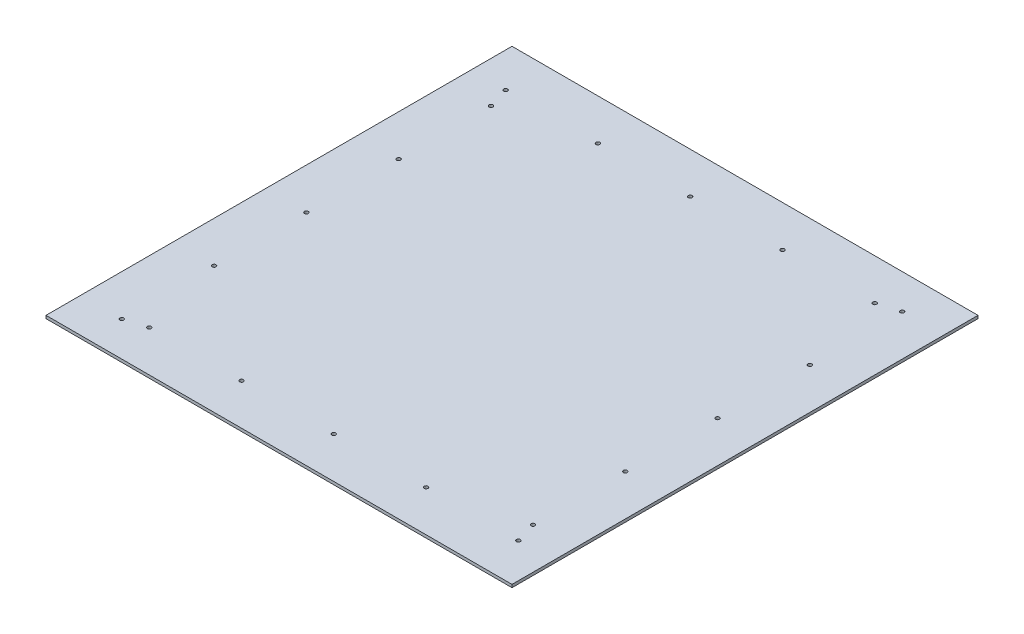
ISO-10303-21;
HEADER;
FILE_DESCRIPTION(('STEP AP214'),'2;1');
FILE_NAME('part.step','',(''),(''),'','','');
FILE_SCHEMA(('AUTOMOTIVE_DESIGN { 1 0 10303 214 1 1 1 1 }'));
ENDSEC;
DATA;
#1=APPLICATION_CONTEXT('core data for automotive mechanical design processes');
#2=APPLICATION_PROTOCOL_DEFINITION('international standard','automotive_design',2000,#1);
#3=PRODUCT_CONTEXT('',#1,'mechanical');
#4=PRODUCT('Part','Part','',(#3));
#5=PRODUCT_RELATED_PRODUCT_CATEGORY('part','',(#4));
#6=PRODUCT_DEFINITION_FORMATION('','',#4);
#7=PRODUCT_DEFINITION_CONTEXT('part definition',#1,'design');
#8=PRODUCT_DEFINITION('design','',#6,#7);
#9=PRODUCT_DEFINITION_SHAPE('','',#8);
#10=(LENGTH_UNIT() NAMED_UNIT(*) SI_UNIT(.MILLI.,.METRE.));
#11=(NAMED_UNIT(*) PLANE_ANGLE_UNIT() SI_UNIT($,.RADIAN.));
#12=(NAMED_UNIT(*) SI_UNIT($,.STERADIAN.) SOLID_ANGLE_UNIT());
#13=UNCERTAINTY_MEASURE_WITH_UNIT(LENGTH_MEASURE(1.E-05),#10,'distance_accuracy_value','');
#14=(GEOMETRIC_REPRESENTATION_CONTEXT(3) GLOBAL_UNCERTAINTY_ASSIGNED_CONTEXT((#13)) GLOBAL_UNIT_ASSIGNED_CONTEXT((#10,
#11,#12)) REPRESENTATION_CONTEXT('',''));
#15=CARTESIAN_POINT('',(0.,0.,0.));
#16=DIRECTION('',(0.,0.,1.));
#17=DIRECTION('',(1.,0.,0.));
#18=AXIS2_PLACEMENT_3D('',#15,#16,#17);
#19=CARTESIAN_POINT('',(255.,3.175,255.));
#20=DIRECTION('',(-1.,0.,0.));
#21=DIRECTION('',(0.,0.,1.));
#22=AXIS2_PLACEMENT_3D('',#19,#20,#21);
#23=PLANE('',#22);
#24=DIRECTION('',(0.,0.,-1.));
#25=VECTOR('',#24,1.);
#26=CARTESIAN_POINT('',(255.,0.,255.));
#27=LINE('',#26,#25);
#28=CARTESIAN_POINT('',(255.,0.,255.));
#29=VERTEX_POINT('',#28);
#30=CARTESIAN_POINT('',(255.,0.,-255.));
#31=VERTEX_POINT('',#30);
#32=EDGE_CURVE('E113',#29,#31,#27,.T.);
#33=ORIENTED_EDGE('',*,*,#32,.T.);
#34=DIRECTION('',(0.,-1.,0.));
#35=VECTOR('',#34,1.);
#36=CARTESIAN_POINT('',(255.,3.175,-255.));
#37=LINE('',#36,#35);
#38=CARTESIAN_POINT('',(255.,3.175,-255.));
#39=VERTEX_POINT('',#38);
#40=EDGE_CURVE('E11',#39,#31,#37,.T.);
#41=ORIENTED_EDGE('',*,*,#40,.F.);
#42=DIRECTION('',(0.,0.,-1.));
#43=VECTOR('',#42,1.);
#44=CARTESIAN_POINT('',(255.,3.175,255.));
#45=LINE('',#44,#43);
#46=CARTESIAN_POINT('',(255.,3.175,255.));
#47=VERTEX_POINT('',#46);
#48=EDGE_CURVE('E96',#47,#39,#45,.T.);
#49=ORIENTED_EDGE('',*,*,#48,.F.);
#50=DIRECTION('',(0.,-1.,0.));
#51=VECTOR('',#50,1.);
#52=CARTESIAN_POINT('',(255.,3.175,255.));
#53=LINE('',#52,#51);
#54=EDGE_CURVE('E109',#47,#29,#53,.T.);
#55=ORIENTED_EDGE('',*,*,#54,.T.);
#56=EDGE_LOOP('',(#33,#41,#49,#55));
#57=FACE_BOUND('',#56,.T.);
#58=ADVANCED_FACE('F39',(#57),#23,.F.);
#59=CARTESIAN_POINT('',(-255.,3.175,-255.));
#60=DIRECTION('',(0.,0.,1.));
#61=DIRECTION('',(1.,0.,0.));
#62=AXIS2_PLACEMENT_3D('',#59,#60,#61);
#63=PLANE('',#62);
#64=DIRECTION('',(-1.,0.,0.));
#65=VECTOR('',#64,1.);
#66=CARTESIAN_POINT('',(-255.,0.,-255.));
#67=LINE('',#66,#65);
#68=CARTESIAN_POINT('',(-255.,0.,-255.));
#69=VERTEX_POINT('',#68);
#70=EDGE_CURVE('E101',#31,#69,#67,.T.);
#71=ORIENTED_EDGE('',*,*,#70,.T.);
#72=DIRECTION('',(0.,-1.,0.));
#73=VECTOR('',#72,1.);
#74=CARTESIAN_POINT('',(-255.,3.175,-255.));
#75=LINE('',#74,#73);
#76=CARTESIAN_POINT('',(-255.,3.175,-255.));
#77=VERTEX_POINT('',#76);
#78=EDGE_CURVE('E47',#77,#69,#75,.T.);
#79=ORIENTED_EDGE('',*,*,#78,.F.);
#80=DIRECTION('',(-1.,0.,0.));
#81=VECTOR('',#80,1.);
#82=CARTESIAN_POINT('',(-255.,3.175,-255.));
#83=LINE('',#82,#81);
#84=EDGE_CURVE('E90',#39,#77,#83,.T.);
#85=ORIENTED_EDGE('',*,*,#84,.F.);
#86=ORIENTED_EDGE('',*,*,#40,.T.);
#87=EDGE_LOOP('',(#71,#79,#85,#86));
#88=FACE_BOUND('',#87,.T.);
#89=ADVANCED_FACE('F100',(#88),#63,.F.);
#90=CARTESIAN_POINT('',(-255.,3.175,255.));
#91=DIRECTION('',(1.,0.,0.));
#92=DIRECTION('',(0.,0.,-1.));
#93=AXIS2_PLACEMENT_3D('',#90,#91,#92);
#94=PLANE('',#93);
#95=DIRECTION('',(0.,0.,1.));
#96=VECTOR('',#95,1.);
#97=CARTESIAN_POINT('',(-255.,0.,255.));
#98=LINE('',#97,#96);
#99=CARTESIAN_POINT('',(-255.,0.,255.));
#100=VERTEX_POINT('',#99);
#101=EDGE_CURVE('E77',#69,#100,#98,.T.);
#102=ORIENTED_EDGE('',*,*,#101,.T.);
#103=DIRECTION('',(0.,-1.,0.));
#104=VECTOR('',#103,1.);
#105=CARTESIAN_POINT('',(-255.,3.175,255.));
#106=LINE('',#105,#104);
#107=CARTESIAN_POINT('',(-255.,3.175,255.));
#108=VERTEX_POINT('',#107);
#109=EDGE_CURVE('E103',#108,#100,#106,.T.);
#110=ORIENTED_EDGE('',*,*,#109,.F.);
#111=DIRECTION('',(0.,0.,1.));
#112=VECTOR('',#111,1.);
#113=CARTESIAN_POINT('',(-255.,3.175,255.));
#114=LINE('',#113,#112);
#115=EDGE_CURVE('E94',#77,#108,#114,.T.);
#116=ORIENTED_EDGE('',*,*,#115,.F.);
#117=ORIENTED_EDGE('',*,*,#78,.T.);
#118=EDGE_LOOP('',(#102,#110,#116,#117));
#119=FACE_BOUND('',#118,.T.);
#120=ADVANCED_FACE('F104',(#119),#94,.F.);
#121=CARTESIAN_POINT('',(-255.,3.175,255.));
#122=DIRECTION('',(0.,0.,-1.));
#123=DIRECTION('',(-1.,0.,0.));
#124=AXIS2_PLACEMENT_3D('',#121,#122,#123);
#125=PLANE('',#124);
#126=DIRECTION('',(1.,0.,0.));
#127=VECTOR('',#126,1.);
#128=CARTESIAN_POINT('',(-255.,0.,255.));
#129=LINE('',#128,#127);
#130=EDGE_CURVE('E83',#100,#29,#129,.T.);
#131=ORIENTED_EDGE('',*,*,#130,.T.);
#132=ORIENTED_EDGE('',*,*,#54,.F.);
#133=DIRECTION('',(1.,0.,0.));
#134=VECTOR('',#133,1.);
#135=CARTESIAN_POINT('',(-255.,3.175,255.));
#136=LINE('',#135,#134);
#137=EDGE_CURVE('E58',#108,#47,#136,.T.);
#138=ORIENTED_EDGE('',*,*,#137,.F.);
#139=ORIENTED_EDGE('',*,*,#109,.T.);
#140=EDGE_LOOP('',(#131,#132,#138,#139));
#141=FACE_BOUND('',#140,.T.);
#142=ADVANCED_FACE('F127',(#141),#125,.F.);
#143=CARTESIAN_POINT('',(0.,3.175,0.));
#144=DIRECTION('',(0.,-1.,0.));
#145=DIRECTION('',(0.,0.,-1.));
#146=AXIS2_PLACEMENT_3D('',#143,#144,#145);
#147=PLANE('',#146);
#148=CARTESIAN_POINT('',(217.,3.175,210.));
#149=DIRECTION('',(0.,-1.,0.));
#150=DIRECTION('',(0.,0.,-1.));
#151=AXIS2_PLACEMENT_3D('',#148,#149,#150);
#152=CIRCLE('',#151,2.09999999999999);
#153=CARTESIAN_POINT('',(217.,3.175,207.9));
#154=VERTEX_POINT('',#153);
#155=EDGE_CURVE('E117',#154,#154,#152,.T.);
#156=ORIENTED_EDGE('',*,*,#155,.T.);
#157=EDGE_LOOP('',(#156));
#158=FACE_BOUND('',#157,.T.);
#159=CARTESIAN_POINT('',(209.999999999999,3.175,187.));
#160=DIRECTION('',(0.,-1.,0.));
#161=DIRECTION('',(0.,0.,-1.));
#162=AXIS2_PLACEMENT_3D('',#159,#160,#161);
#163=CIRCLE('',#162,2.09999999999999);
#164=CARTESIAN_POINT('',(209.999999999999,3.175,184.9));
#165=VERTEX_POINT('',#164);
#166=EDGE_CURVE('E265',#165,#165,#163,.T.);
#167=ORIENTED_EDGE('',*,*,#166,.T.);
#168=EDGE_LOOP('',(#167));
#169=FACE_BOUND('',#168,.T.);
#170=CARTESIAN_POINT('',(209.999999999999,3.175,86.0000000000001));
#171=DIRECTION('',(0.,-1.,0.));
#172=DIRECTION('',(0.,0.,-1.));
#173=AXIS2_PLACEMENT_3D('',#170,#171,#172);
#174=CIRCLE('',#173,2.09999999999999);
#175=CARTESIAN_POINT('',(209.999999999999,3.175,83.9000000000001));
#176=VERTEX_POINT('',#175);
#177=EDGE_CURVE('E272',#176,#176,#174,.T.);
#178=ORIENTED_EDGE('',*,*,#177,.T.);
#179=EDGE_LOOP('',(#178));
#180=FACE_BOUND('',#179,.T.);
#181=CARTESIAN_POINT('',(209.999999999999,3.175,-15.));
#182=DIRECTION('',(0.,-1.,0.));
#183=DIRECTION('',(0.,0.,-1.));
#184=AXIS2_PLACEMENT_3D('',#181,#182,#183);
#185=CIRCLE('',#184,2.09999999999999);
#186=CARTESIAN_POINT('',(209.999999999999,3.175,-17.0999999999999));
#187=VERTEX_POINT('',#186);
#188=EDGE_CURVE('E235',#187,#187,#185,.T.);
#189=ORIENTED_EDGE('',*,*,#188,.T.);
#190=EDGE_LOOP('',(#189));
#191=FACE_BOUND('',#190,.T.);
#192=CARTESIAN_POINT('',(-187.,3.175,209.999999999997));
#193=DIRECTION('',(0.,-1.,0.));
#194=DIRECTION('',(0.,0.,-1.));
#195=AXIS2_PLACEMENT_3D('',#192,#193,#194);
#196=CIRCLE('',#195,2.09999999999999);
#197=CARTESIAN_POINT('',(-187.,3.175,207.899999999997));
#198=VERTEX_POINT('',#197);
#199=EDGE_CURVE('E158',#198,#198,#196,.T.);
#200=ORIENTED_EDGE('',*,*,#199,.T.);
#201=EDGE_LOOP('',(#200));
#202=FACE_BOUND('',#201,.T.);
#203=CARTESIAN_POINT('',(-217.,3.175,-210.));
#204=DIRECTION('',(0.,-1.,0.));
#205=DIRECTION('',(0.,0.,-1.));
#206=AXIS2_PLACEMENT_3D('',#203,#204,#205);
#207=CIRCLE('',#206,2.09999999999999);
#208=CARTESIAN_POINT('',(-217.,3.175,-212.1));
#209=VERTEX_POINT('',#208);
#210=EDGE_CURVE('E173',#209,#209,#207,.T.);
#211=ORIENTED_EDGE('',*,*,#210,.T.);
#212=EDGE_LOOP('',(#211));
#213=FACE_BOUND('',#212,.T.);
#214=CARTESIAN_POINT('',(-209.999999999999,3.175,116.));
#215=DIRECTION('',(0.,-1.,0.));
#216=DIRECTION('',(0.,0.,-1.));
#217=AXIS2_PLACEMENT_3D('',#214,#215,#216);
#218=CIRCLE('',#217,2.09999999999999);
#219=CARTESIAN_POINT('',(-209.999999999999,3.175,113.9));
#220=VERTEX_POINT('',#219);
#221=EDGE_CURVE('E174',#220,#220,#218,.T.);
#222=ORIENTED_EDGE('',*,*,#221,.T.);
#223=EDGE_LOOP('',(#222));
#224=FACE_BOUND('',#223,.T.);
#225=CARTESIAN_POINT('',(-209.999999999998,3.175,15.));
#226=DIRECTION('',(0.,-1.,0.));
#227=DIRECTION('',(0.,0.,-1.));
#228=AXIS2_PLACEMENT_3D('',#225,#226,#227);
#229=CIRCLE('',#228,2.09999999999999);
#230=CARTESIAN_POINT('',(-209.999999999998,3.175,12.9));
#231=VERTEX_POINT('',#230);
#232=EDGE_CURVE('E189',#231,#231,#229,.T.);
#233=ORIENTED_EDGE('',*,*,#232,.T.);
#234=EDGE_LOOP('',(#233));
#235=FACE_BOUND('',#234,.T.);
#236=CARTESIAN_POINT('',(-210.,3.175,217.));
#237=DIRECTION('',(0.,-1.,0.));
#238=DIRECTION('',(0.,0.,-1.));
#239=AXIS2_PLACEMENT_3D('',#236,#237,#238);
#240=CIRCLE('',#239,2.09999999999999);
#241=CARTESIAN_POINT('',(-210.,3.175,214.9));
#242=VERTEX_POINT('',#241);
#243=EDGE_CURVE('E148',#242,#242,#240,.T.);
#244=ORIENTED_EDGE('',*,*,#243,.T.);
#245=EDGE_LOOP('',(#244));
#246=FACE_BOUND('',#245,.T.);
#247=CARTESIAN_POINT('',(116.,3.175,209.999999999999));
#248=DIRECTION('',(0.,-1.,0.));
#249=DIRECTION('',(0.,0.,-1.));
#250=AXIS2_PLACEMENT_3D('',#247,#248,#249);
#251=CIRCLE('',#250,2.1);
#252=CARTESIAN_POINT('',(116.,3.175,207.899999999999));
#253=VERTEX_POINT('',#252);
#254=EDGE_CURVE('E139',#253,#253,#251,.T.);
#255=ORIENTED_EDGE('',*,*,#254,.T.);
#256=EDGE_LOOP('',(#255));
#257=FACE_BOUND('',#256,.T.);
#258=CARTESIAN_POINT('',(15.,3.175,209.999999999999));
#259=DIRECTION('',(0.,-1.,0.));
#260=DIRECTION('',(0.,0.,-1.));
#261=AXIS2_PLACEMENT_3D('',#258,#259,#260);
#262=CIRCLE('',#261,2.1);
#263=CARTESIAN_POINT('',(15.,3.175,207.899999999999));
#264=VERTEX_POINT('',#263);
#265=EDGE_CURVE('E140',#264,#264,#262,.T.);
#266=ORIENTED_EDGE('',*,*,#265,.T.);
#267=EDGE_LOOP('',(#266));
#268=FACE_BOUND('',#267,.T.);
#269=CARTESIAN_POINT('',(-86.0000000000001,3.175,209.999999999998));
#270=DIRECTION('',(0.,-1.,0.));
#271=DIRECTION('',(0.,0.,-1.));
#272=AXIS2_PLACEMENT_3D('',#269,#270,#271);
#273=CIRCLE('',#272,2.1);
#274=CARTESIAN_POINT('',(-86.0000000000001,3.175,207.899999999998));
#275=VERTEX_POINT('',#274);
#276=EDGE_CURVE('E157',#275,#275,#273,.T.);
#277=ORIENTED_EDGE('',*,*,#276,.T.);
#278=EDGE_LOOP('',(#277));
#279=FACE_BOUND('',#278,.T.);
#280=CARTESIAN_POINT('',(210.,3.175,-116.));
#281=DIRECTION('',(0.,-1.,0.));
#282=DIRECTION('',(0.,0.,-1.));
#283=AXIS2_PLACEMENT_3D('',#280,#281,#282);
#284=CIRCLE('',#283,2.09999999999999);
#285=CARTESIAN_POINT('',(210.,3.175,-118.1));
#286=VERTEX_POINT('',#285);
#287=EDGE_CURVE('E234',#286,#286,#284,.T.);
#288=ORIENTED_EDGE('',*,*,#287,.T.);
#289=EDGE_LOOP('',(#288));
#290=FACE_BOUND('',#289,.T.);
#291=CARTESIAN_POINT('',(187.,3.175,-210.));
#292=DIRECTION('',(0.,-1.,0.));
#293=DIRECTION('',(0.,0.,-1.));
#294=AXIS2_PLACEMENT_3D('',#291,#292,#293);
#295=CIRCLE('',#294,2.09999999999999);
#296=CARTESIAN_POINT('',(187.,3.175,-212.1));
#297=VERTEX_POINT('',#296);
#298=EDGE_CURVE('E243',#297,#297,#295,.T.);
#299=ORIENTED_EDGE('',*,*,#298,.T.);
#300=EDGE_LOOP('',(#299));
#301=FACE_BOUND('',#300,.T.);
#302=CARTESIAN_POINT('',(86.0000000000001,3.175,-210.));
#303=DIRECTION('',(0.,-1.,0.));
#304=DIRECTION('',(0.,0.,-1.));
#305=AXIS2_PLACEMENT_3D('',#302,#303,#304);
#306=CIRCLE('',#305,2.1);
#307=CARTESIAN_POINT('',(86.0000000000001,3.175,-212.1));
#308=VERTEX_POINT('',#307);
#309=EDGE_CURVE('E251',#308,#308,#306,.T.);
#310=ORIENTED_EDGE('',*,*,#309,.T.);
#311=EDGE_LOOP('',(#310));
#312=FACE_BOUND('',#311,.T.);
#313=CARTESIAN_POINT('',(-15.,3.175,-210.));
#314=DIRECTION('',(0.,-1.,0.));
#315=DIRECTION('',(0.,0.,-1.));
#316=AXIS2_PLACEMENT_3D('',#313,#314,#315);
#317=CIRCLE('',#316,2.1);
#318=CARTESIAN_POINT('',(-15.,3.175,-212.1));
#319=VERTEX_POINT('',#318);
#320=EDGE_CURVE('E206',#319,#319,#317,.T.);
#321=ORIENTED_EDGE('',*,*,#320,.T.);
#322=EDGE_LOOP('',(#321));
#323=FACE_BOUND('',#322,.T.);
#324=CARTESIAN_POINT('',(-116.,3.175,-210.));
#325=DIRECTION('',(0.,-1.,0.));
#326=DIRECTION('',(0.,0.,-1.));
#327=AXIS2_PLACEMENT_3D('',#324,#325,#326);
#328=CIRCLE('',#327,2.1);
#329=CARTESIAN_POINT('',(-116.,3.175,-212.1));
#330=VERTEX_POINT('',#329);
#331=EDGE_CURVE('E205',#330,#330,#328,.T.);
#332=ORIENTED_EDGE('',*,*,#331,.T.);
#333=EDGE_LOOP('',(#332));
#334=FACE_BOUND('',#333,.T.);
#335=CARTESIAN_POINT('',(210.,3.175,-217.));
#336=DIRECTION('',(0.,-1.,0.));
#337=DIRECTION('',(0.,0.,-1.));
#338=AXIS2_PLACEMENT_3D('',#335,#336,#337);
#339=CIRCLE('',#338,2.09999999999999);
#340=CARTESIAN_POINT('',(210.,3.175,-219.1));
#341=VERTEX_POINT('',#340);
#342=EDGE_CURVE('E213',#341,#341,#339,.T.);
#343=ORIENTED_EDGE('',*,*,#342,.T.);
#344=EDGE_LOOP('',(#343));
#345=FACE_BOUND('',#344,.T.);
#346=CARTESIAN_POINT('',(-209.999999999996,3.175,-187.));
#347=DIRECTION('',(0.,-1.,0.));
#348=DIRECTION('',(0.,0.,-1.));
#349=AXIS2_PLACEMENT_3D('',#346,#347,#348);
#350=CIRCLE('',#349,2.09999999999999);
#351=CARTESIAN_POINT('',(-209.999999999996,3.175,-189.1));
#352=VERTEX_POINT('',#351);
#353=EDGE_CURVE('E220',#352,#352,#350,.T.);
#354=ORIENTED_EDGE('',*,*,#353,.T.);
#355=EDGE_LOOP('',(#354));
#356=FACE_BOUND('',#355,.T.);
#357=CARTESIAN_POINT('',(-209.999999999997,3.175,-86.0000000000001));
#358=DIRECTION('',(0.,-1.,0.));
#359=DIRECTION('',(0.,0.,-1.));
#360=AXIS2_PLACEMENT_3D('',#357,#358,#359);
#361=CIRCLE('',#360,2.09999999999999);
#362=CARTESIAN_POINT('',(-209.999999999997,3.175,-88.1000000000001));
#363=VERTEX_POINT('',#362);
#364=EDGE_CURVE('E190',#363,#363,#361,.T.);
#365=ORIENTED_EDGE('',*,*,#364,.T.);
#366=EDGE_LOOP('',(#365));
#367=FACE_BOUND('',#366,.T.);
#368=ORIENTED_EDGE('',*,*,#48,.T.);
#369=ORIENTED_EDGE('',*,*,#84,.T.);
#370=ORIENTED_EDGE('',*,*,#115,.T.);
#371=ORIENTED_EDGE('',*,*,#137,.T.);
#372=EDGE_LOOP('',(#368,#369,#370,#371));
#373=FACE_BOUND('',#372,.T.);
#374=ADVANCED_FACE('F92',(#158,#169,#180,#191,#202,#213,#224,#235,#246,#257,#268,#279,#290,#301,
#312,#323,#334,#345,#356,#367,#373),#147,.F.);
#375=CARTESIAN_POINT('',(0.,0.,0.));
#376=DIRECTION('',(0.,-1.,0.));
#377=DIRECTION('',(0.,0.,-1.));
#378=AXIS2_PLACEMENT_3D('',#375,#376,#377);
#379=PLANE('',#378);
#380=CARTESIAN_POINT('',(217.,0.,210.));
#381=DIRECTION('',(0.,-1.,0.));
#382=DIRECTION('',(0.,0.,-1.));
#383=AXIS2_PLACEMENT_3D('',#380,#381,#382);
#384=CIRCLE('',#383,2.09999999999999);
#385=CARTESIAN_POINT('',(217.,0.,207.9));
#386=VERTEX_POINT('',#385);
#387=EDGE_CURVE('E152',#386,#386,#384,.T.);
#388=ORIENTED_EDGE('',*,*,#387,.F.);
#389=EDGE_LOOP('',(#388));
#390=FACE_BOUND('',#389,.T.);
#391=CARTESIAN_POINT('',(209.999999999999,0.,187.));
#392=DIRECTION('',(0.,-1.,0.));
#393=DIRECTION('',(0.,0.,-1.));
#394=AXIS2_PLACEMENT_3D('',#391,#392,#393);
#395=CIRCLE('',#394,2.09999999999999);
#396=CARTESIAN_POINT('',(209.999999999999,0.,184.9));
#397=VERTEX_POINT('',#396);
#398=EDGE_CURVE('E262',#397,#397,#395,.T.);
#399=ORIENTED_EDGE('',*,*,#398,.F.);
#400=EDGE_LOOP('',(#399));
#401=FACE_BOUND('',#400,.T.);
#402=CARTESIAN_POINT('',(209.999999999999,0.,86.0000000000001));
#403=DIRECTION('',(0.,-1.,0.));
#404=DIRECTION('',(0.,0.,-1.));
#405=AXIS2_PLACEMENT_3D('',#402,#403,#404);
#406=CIRCLE('',#405,2.09999999999999);
#407=CARTESIAN_POINT('',(209.999999999999,0.,83.9000000000001));
#408=VERTEX_POINT('',#407);
#409=EDGE_CURVE('E268',#408,#408,#406,.T.);
#410=ORIENTED_EDGE('',*,*,#409,.F.);
#411=EDGE_LOOP('',(#410));
#412=FACE_BOUND('',#411,.T.);
#413=CARTESIAN_POINT('',(209.999999999999,0.,-15.));
#414=DIRECTION('',(0.,-1.,0.));
#415=DIRECTION('',(0.,0.,-1.));
#416=AXIS2_PLACEMENT_3D('',#413,#414,#415);
#417=CIRCLE('',#416,2.09999999999999);
#418=CARTESIAN_POINT('',(209.999999999999,0.,-17.0999999999999));
#419=VERTEX_POINT('',#418);
#420=EDGE_CURVE('E275',#419,#419,#417,.T.);
#421=ORIENTED_EDGE('',*,*,#420,.F.);
#422=EDGE_LOOP('',(#421));
#423=FACE_BOUND('',#422,.T.);
#424=CARTESIAN_POINT('',(-187.,0.,209.999999999997));
#425=DIRECTION('',(0.,-1.,0.));
#426=DIRECTION('',(0.,0.,-1.));
#427=AXIS2_PLACEMENT_3D('',#424,#425,#426);
#428=CIRCLE('',#427,2.09999999999999);
#429=CARTESIAN_POINT('',(-187.,0.,207.899999999997));
#430=VERTEX_POINT('',#429);
#431=EDGE_CURVE('E178',#430,#430,#428,.T.);
#432=ORIENTED_EDGE('',*,*,#431,.F.);
#433=EDGE_LOOP('',(#432));
#434=FACE_BOUND('',#433,.T.);
#435=CARTESIAN_POINT('',(-217.,0.,-210.));
#436=DIRECTION('',(0.,-1.,0.));
#437=DIRECTION('',(0.,0.,-1.));
#438=AXIS2_PLACEMENT_3D('',#435,#436,#437);
#439=CIRCLE('',#438,2.09999999999999);
#440=CARTESIAN_POINT('',(-217.,0.,-212.1));
#441=VERTEX_POINT('',#440);
#442=EDGE_CURVE('E169',#441,#441,#439,.T.);
#443=ORIENTED_EDGE('',*,*,#442,.F.);
#444=EDGE_LOOP('',(#443));
#445=FACE_BOUND('',#444,.T.);
#446=CARTESIAN_POINT('',(-209.999999999999,0.,116.));
#447=DIRECTION('',(0.,-1.,0.));
#448=DIRECTION('',(0.,0.,-1.));
#449=AXIS2_PLACEMENT_3D('',#446,#447,#448);
#450=CIRCLE('',#449,2.09999999999999);
#451=CARTESIAN_POINT('',(-209.999999999999,0.,113.9));
#452=VERTEX_POINT('',#451);
#453=EDGE_CURVE('E194',#452,#452,#450,.T.);
#454=ORIENTED_EDGE('',*,*,#453,.F.);
#455=EDGE_LOOP('',(#454));
#456=FACE_BOUND('',#455,.T.);
#457=CARTESIAN_POINT('',(-209.999999999998,0.,15.));
#458=DIRECTION('',(0.,-1.,0.));
#459=DIRECTION('',(0.,0.,-1.));
#460=AXIS2_PLACEMENT_3D('',#457,#458,#459);
#461=CIRCLE('',#460,2.09999999999999);
#462=CARTESIAN_POINT('',(-209.999999999998,0.,12.9));
#463=VERTEX_POINT('',#462);
#464=EDGE_CURVE('E185',#463,#463,#461,.T.);
#465=ORIENTED_EDGE('',*,*,#464,.F.);
#466=EDGE_LOOP('',(#465));
#467=FACE_BOUND('',#466,.T.);
#468=CARTESIAN_POINT('',(-210.,0.,217.));
#469=DIRECTION('',(0.,-1.,0.));
#470=DIRECTION('',(0.,0.,-1.));
#471=AXIS2_PLACEMENT_3D('',#468,#469,#470);
#472=CIRCLE('',#471,2.09999999999999);
#473=CARTESIAN_POINT('',(-210.,0.,214.9));
#474=VERTEX_POINT('',#473);
#475=EDGE_CURVE('E144',#474,#474,#472,.T.);
#476=ORIENTED_EDGE('',*,*,#475,.F.);
#477=EDGE_LOOP('',(#476));
#478=FACE_BOUND('',#477,.T.);
#479=CARTESIAN_POINT('',(116.,0.,209.999999999999));
#480=DIRECTION('',(0.,-1.,0.));
#481=DIRECTION('',(0.,0.,-1.));
#482=AXIS2_PLACEMENT_3D('',#479,#480,#481);
#483=CIRCLE('',#482,2.1);
#484=CARTESIAN_POINT('',(116.,0.,207.899999999999));
#485=VERTEX_POINT('',#484);
#486=EDGE_CURVE('E135',#485,#485,#483,.T.);
#487=ORIENTED_EDGE('',*,*,#486,.F.);
#488=EDGE_LOOP('',(#487));
#489=FACE_BOUND('',#488,.T.);
#490=CARTESIAN_POINT('',(15.,0.,209.999999999999));
#491=DIRECTION('',(0.,-1.,0.));
#492=DIRECTION('',(0.,0.,-1.));
#493=AXIS2_PLACEMENT_3D('',#490,#491,#492);
#494=CIRCLE('',#493,2.1);
#495=CARTESIAN_POINT('',(15.,0.,207.899999999999));
#496=VERTEX_POINT('',#495);
#497=EDGE_CURVE('E162',#496,#496,#494,.T.);
#498=ORIENTED_EDGE('',*,*,#497,.F.);
#499=EDGE_LOOP('',(#498));
#500=FACE_BOUND('',#499,.T.);
#501=CARTESIAN_POINT('',(-86.0000000000001,0.,209.999999999998));
#502=DIRECTION('',(0.,-1.,0.));
#503=DIRECTION('',(0.,0.,-1.));
#504=AXIS2_PLACEMENT_3D('',#501,#502,#503);
#505=CIRCLE('',#504,2.1);
#506=CARTESIAN_POINT('',(-86.0000000000001,0.,207.899999999998));
#507=VERTEX_POINT('',#506);
#508=EDGE_CURVE('E153',#507,#507,#505,.T.);
#509=ORIENTED_EDGE('',*,*,#508,.F.);
#510=EDGE_LOOP('',(#509));
#511=FACE_BOUND('',#510,.T.);
#512=CARTESIAN_POINT('',(210.,0.,-116.));
#513=DIRECTION('',(0.,-1.,0.));
#514=DIRECTION('',(0.,0.,-1.));
#515=AXIS2_PLACEMENT_3D('',#512,#513,#514);
#516=CIRCLE('',#515,2.09999999999999);
#517=CARTESIAN_POINT('',(210.,0.,-118.1));
#518=VERTEX_POINT('',#517);
#519=EDGE_CURVE('E230',#518,#518,#516,.T.);
#520=ORIENTED_EDGE('',*,*,#519,.F.);
#521=EDGE_LOOP('',(#520));
#522=FACE_BOUND('',#521,.T.);
#523=CARTESIAN_POINT('',(187.,0.,-210.));
#524=DIRECTION('',(0.,-1.,0.));
#525=DIRECTION('',(0.,0.,-1.));
#526=AXIS2_PLACEMENT_3D('',#523,#524,#525);
#527=CIRCLE('',#526,2.09999999999999);
#528=CARTESIAN_POINT('',(187.,0.,-212.1));
#529=VERTEX_POINT('',#528);
#530=EDGE_CURVE('E239',#529,#529,#527,.T.);
#531=ORIENTED_EDGE('',*,*,#530,.F.);
#532=EDGE_LOOP('',(#531));
#533=FACE_BOUND('',#532,.T.);
#534=CARTESIAN_POINT('',(86.0000000000001,0.,-210.));
#535=DIRECTION('',(0.,-1.,0.));
#536=DIRECTION('',(0.,0.,-1.));
#537=AXIS2_PLACEMENT_3D('',#534,#535,#536);
#538=CIRCLE('',#537,2.1);
#539=CARTESIAN_POINT('',(86.0000000000001,0.,-212.1));
#540=VERTEX_POINT('',#539);
#541=EDGE_CURVE('E247',#540,#540,#538,.T.);
#542=ORIENTED_EDGE('',*,*,#541,.F.);
#543=EDGE_LOOP('',(#542));
#544=FACE_BOUND('',#543,.T.);
#545=CARTESIAN_POINT('',(-15.,0.,-210.));
#546=DIRECTION('',(0.,-1.,0.));
#547=DIRECTION('',(0.,0.,-1.));
#548=AXIS2_PLACEMENT_3D('',#545,#546,#547);
#549=CIRCLE('',#548,2.1);
#550=CARTESIAN_POINT('',(-15.,0.,-212.1));
#551=VERTEX_POINT('',#550);
#552=EDGE_CURVE('E255',#551,#551,#549,.T.);
#553=ORIENTED_EDGE('',*,*,#552,.F.);
#554=EDGE_LOOP('',(#553));
#555=FACE_BOUND('',#554,.T.);
#556=CARTESIAN_POINT('',(-116.,0.,-210.));
#557=DIRECTION('',(0.,-1.,0.));
#558=DIRECTION('',(0.,0.,-1.));
#559=AXIS2_PLACEMENT_3D('',#556,#557,#558);
#560=CIRCLE('',#559,2.1);
#561=CARTESIAN_POINT('',(-116.,0.,-212.1));
#562=VERTEX_POINT('',#561);
#563=EDGE_CURVE('E201',#562,#562,#560,.T.);
#564=ORIENTED_EDGE('',*,*,#563,.F.);
#565=EDGE_LOOP('',(#564));
#566=FACE_BOUND('',#565,.T.);
#567=CARTESIAN_POINT('',(210.,0.,-217.));
#568=DIRECTION('',(0.,-1.,0.));
#569=DIRECTION('',(0.,0.,-1.));
#570=AXIS2_PLACEMENT_3D('',#567,#568,#569);
#571=CIRCLE('',#570,2.09999999999999);
#572=CARTESIAN_POINT('',(210.,0.,-219.1));
#573=VERTEX_POINT('',#572);
#574=EDGE_CURVE('E210',#573,#573,#571,.T.);
#575=ORIENTED_EDGE('',*,*,#574,.F.);
#576=EDGE_LOOP('',(#575));
#577=FACE_BOUND('',#576,.T.);
#578=CARTESIAN_POINT('',(-209.999999999996,0.,-187.));
#579=DIRECTION('',(0.,-1.,0.));
#580=DIRECTION('',(0.,0.,-1.));
#581=AXIS2_PLACEMENT_3D('',#578,#579,#580);
#582=CIRCLE('',#581,2.09999999999999);
#583=CARTESIAN_POINT('',(-209.999999999996,0.,-189.1));
#584=VERTEX_POINT('',#583);
#585=EDGE_CURVE('E216',#584,#584,#582,.T.);
#586=ORIENTED_EDGE('',*,*,#585,.F.);
#587=EDGE_LOOP('',(#586));
#588=FACE_BOUND('',#587,.T.);
#589=CARTESIAN_POINT('',(-209.999999999997,0.,-86.0000000000001));
#590=DIRECTION('',(0.,-1.,0.));
#591=DIRECTION('',(0.,0.,-1.));
#592=AXIS2_PLACEMENT_3D('',#589,#590,#591);
#593=CIRCLE('',#592,2.09999999999999);
#594=CARTESIAN_POINT('',(-209.999999999997,0.,-88.1000000000001));
#595=VERTEX_POINT('',#594);
#596=EDGE_CURVE('E223',#595,#595,#593,.T.);
#597=ORIENTED_EDGE('',*,*,#596,.F.);
#598=EDGE_LOOP('',(#597));
#599=FACE_BOUND('',#598,.T.);
#600=ORIENTED_EDGE('',*,*,#32,.F.);
#601=ORIENTED_EDGE('',*,*,#130,.F.);
#602=ORIENTED_EDGE('',*,*,#101,.F.);
#603=ORIENTED_EDGE('',*,*,#70,.F.);
#604=EDGE_LOOP('',(#600,#601,#602,#603));
#605=FACE_BOUND('',#604,.T.);
#606=ADVANCED_FACE('F130',(#390,#401,#412,#423,#434,#445,#456,#467,#478,#489,#500,#511,#522,
#533,#544,#555,#566,#577,#588,#599,#605),#379,.T.);
#607=CARTESIAN_POINT('',(-209.999999999997,3.175,-86.0000000000001));
#608=DIRECTION('',(0.,-1.,0.));
#609=DIRECTION('',(0.,0.,-1.));
#610=AXIS2_PLACEMENT_3D('',#607,#608,#609);
#611=CYLINDRICAL_SURFACE('',#610,2.09999999999999);
#612=ORIENTED_EDGE('',*,*,#364,.F.);
#613=EDGE_LOOP('',(#612));
#614=FACE_BOUND('',#613,.T.);
#615=ORIENTED_EDGE('',*,*,#596,.T.);
#616=EDGE_LOOP('',(#615));
#617=FACE_BOUND('',#616,.T.);
#618=ADVANCED_FACE('F300',(#614,#617),#611,.F.);
#619=CARTESIAN_POINT('',(-209.999999999996,3.175,-187.));
#620=DIRECTION('',(0.,-1.,0.));
#621=DIRECTION('',(0.,0.,-1.));
#622=AXIS2_PLACEMENT_3D('',#619,#620,#621);
#623=CYLINDRICAL_SURFACE('',#622,2.09999999999999);
#624=ORIENTED_EDGE('',*,*,#353,.F.);
#625=EDGE_LOOP('',(#624));
#626=FACE_BOUND('',#625,.T.);
#627=ORIENTED_EDGE('',*,*,#585,.T.);
#628=EDGE_LOOP('',(#627));
#629=FACE_BOUND('',#628,.T.);
#630=ADVANCED_FACE('F341',(#626,#629),#623,.F.);
#631=CARTESIAN_POINT('',(210.,3.175,-217.));
#632=DIRECTION('',(0.,-1.,0.));
#633=DIRECTION('',(0.,0.,-1.));
#634=AXIS2_PLACEMENT_3D('',#631,#632,#633);
#635=CYLINDRICAL_SURFACE('',#634,2.09999999999999);
#636=ORIENTED_EDGE('',*,*,#342,.F.);
#637=EDGE_LOOP('',(#636));
#638=FACE_BOUND('',#637,.T.);
#639=ORIENTED_EDGE('',*,*,#574,.T.);
#640=EDGE_LOOP('',(#639));
#641=FACE_BOUND('',#640,.T.);
#642=ADVANCED_FACE('F347',(#638,#641),#635,.F.);
#643=CARTESIAN_POINT('',(-116.,3.175,-210.));
#644=DIRECTION('',(0.,-1.,0.));
#645=DIRECTION('',(0.,0.,-1.));
#646=AXIS2_PLACEMENT_3D('',#643,#644,#645);
#647=CYLINDRICAL_SURFACE('',#646,2.1);
#648=ORIENTED_EDGE('',*,*,#331,.F.);
#649=EDGE_LOOP('',(#648));
#650=FACE_BOUND('',#649,.T.);
#651=ORIENTED_EDGE('',*,*,#563,.T.);
#652=EDGE_LOOP('',(#651));
#653=FACE_BOUND('',#652,.T.);
#654=ADVANCED_FACE('F399',(#650,#653),#647,.F.);
#655=CARTESIAN_POINT('',(-15.,3.175,-210.));
#656=DIRECTION('',(0.,-1.,0.));
#657=DIRECTION('',(0.,0.,-1.));
#658=AXIS2_PLACEMENT_3D('',#655,#656,#657);
#659=CYLINDRICAL_SURFACE('',#658,2.1);
#660=ORIENTED_EDGE('',*,*,#320,.F.);
#661=EDGE_LOOP('',(#660));
#662=FACE_BOUND('',#661,.T.);
#663=ORIENTED_EDGE('',*,*,#552,.T.);
#664=EDGE_LOOP('',(#663));
#665=FACE_BOUND('',#664,.T.);
#666=ADVANCED_FACE('F402',(#662,#665),#659,.F.);
#667=CARTESIAN_POINT('',(86.0000000000001,3.175,-210.));
#668=DIRECTION('',(0.,-1.,0.));
#669=DIRECTION('',(0.,0.,-1.));
#670=AXIS2_PLACEMENT_3D('',#667,#668,#669);
#671=CYLINDRICAL_SURFACE('',#670,2.1);
#672=ORIENTED_EDGE('',*,*,#309,.F.);
#673=EDGE_LOOP('',(#672));
#674=FACE_BOUND('',#673,.T.);
#675=ORIENTED_EDGE('',*,*,#541,.T.);
#676=EDGE_LOOP('',(#675));
#677=FACE_BOUND('',#676,.T.);
#678=ADVANCED_FACE('F427',(#674,#677),#671,.F.);
#679=CARTESIAN_POINT('',(187.,3.175,-210.));
#680=DIRECTION('',(0.,-1.,0.));
#681=DIRECTION('',(0.,0.,-1.));
#682=AXIS2_PLACEMENT_3D('',#679,#680,#681);
#683=CYLINDRICAL_SURFACE('',#682,2.09999999999999);
#684=ORIENTED_EDGE('',*,*,#298,.F.);
#685=EDGE_LOOP('',(#684));
#686=FACE_BOUND('',#685,.T.);
#687=ORIENTED_EDGE('',*,*,#530,.T.);
#688=EDGE_LOOP('',(#687));
#689=FACE_BOUND('',#688,.T.);
#690=ADVANCED_FACE('F435',(#686,#689),#683,.F.);
#691=CARTESIAN_POINT('',(210.,3.175,-116.));
#692=DIRECTION('',(0.,-1.,0.));
#693=DIRECTION('',(0.,0.,-1.));
#694=AXIS2_PLACEMENT_3D('',#691,#692,#693);
#695=CYLINDRICAL_SURFACE('',#694,2.09999999999999);
#696=ORIENTED_EDGE('',*,*,#287,.F.);
#697=EDGE_LOOP('',(#696));
#698=FACE_BOUND('',#697,.T.);
#699=ORIENTED_EDGE('',*,*,#519,.T.);
#700=EDGE_LOOP('',(#699));
#701=FACE_BOUND('',#700,.T.);
#702=ADVANCED_FACE('F378',(#698,#701),#695,.F.);
#703=CARTESIAN_POINT('',(-86.0000000000001,3.175,209.999999999998));
#704=DIRECTION('',(0.,-1.,0.));
#705=DIRECTION('',(0.,0.,-1.));
#706=AXIS2_PLACEMENT_3D('',#703,#704,#705);
#707=CYLINDRICAL_SURFACE('',#706,2.1);
#708=ORIENTED_EDGE('',*,*,#276,.F.);
#709=EDGE_LOOP('',(#708));
#710=FACE_BOUND('',#709,.T.);
#711=ORIENTED_EDGE('',*,*,#508,.T.);
#712=EDGE_LOOP('',(#711));
#713=FACE_BOUND('',#712,.T.);
#714=ADVANCED_FACE('F375',(#710,#713),#707,.F.);
#715=CARTESIAN_POINT('',(15.,3.175,209.999999999999));
#716=DIRECTION('',(0.,-1.,0.));
#717=DIRECTION('',(0.,0.,-1.));
#718=AXIS2_PLACEMENT_3D('',#715,#716,#717);
#719=CYLINDRICAL_SURFACE('',#718,2.1);
#720=ORIENTED_EDGE('',*,*,#265,.F.);
#721=EDGE_LOOP('',(#720));
#722=FACE_BOUND('',#721,.T.);
#723=ORIENTED_EDGE('',*,*,#497,.T.);
#724=EDGE_LOOP('',(#723));
#725=FACE_BOUND('',#724,.T.);
#726=ADVANCED_FACE('F369',(#722,#725),#719,.F.);
#727=CARTESIAN_POINT('',(116.,3.175,209.999999999999));
#728=DIRECTION('',(0.,-1.,0.));
#729=DIRECTION('',(0.,0.,-1.));
#730=AXIS2_PLACEMENT_3D('',#727,#728,#729);
#731=CYLINDRICAL_SURFACE('',#730,2.1);
#732=ORIENTED_EDGE('',*,*,#254,.F.);
#733=EDGE_LOOP('',(#732));
#734=FACE_BOUND('',#733,.T.);
#735=ORIENTED_EDGE('',*,*,#486,.T.);
#736=EDGE_LOOP('',(#735));
#737=FACE_BOUND('',#736,.T.);
#738=ADVANCED_FACE('F365',(#734,#737),#731,.F.);
#739=CARTESIAN_POINT('',(-210.,3.175,217.));
#740=DIRECTION('',(0.,-1.,0.));
#741=DIRECTION('',(0.,0.,-1.));
#742=AXIS2_PLACEMENT_3D('',#739,#740,#741);
#743=CYLINDRICAL_SURFACE('',#742,2.09999999999999);
#744=ORIENTED_EDGE('',*,*,#243,.F.);
#745=EDGE_LOOP('',(#744));
#746=FACE_BOUND('',#745,.T.);
#747=ORIENTED_EDGE('',*,*,#475,.T.);
#748=EDGE_LOOP('',(#747));
#749=FACE_BOUND('',#748,.T.);
#750=ADVANCED_FACE('F368',(#746,#749),#743,.F.);
#751=CARTESIAN_POINT('',(-209.999999999998,3.175,15.));
#752=DIRECTION('',(0.,-1.,0.));
#753=DIRECTION('',(0.,0.,-1.));
#754=AXIS2_PLACEMENT_3D('',#751,#752,#753);
#755=CYLINDRICAL_SURFACE('',#754,2.09999999999999);
#756=ORIENTED_EDGE('',*,*,#232,.F.);
#757=EDGE_LOOP('',(#756));
#758=FACE_BOUND('',#757,.T.);
#759=ORIENTED_EDGE('',*,*,#464,.T.);
#760=EDGE_LOOP('',(#759));
#761=FACE_BOUND('',#760,.T.);
#762=ADVANCED_FACE('F373',(#758,#761),#755,.F.);
#763=CARTESIAN_POINT('',(-209.999999999999,3.175,116.));
#764=DIRECTION('',(0.,-1.,0.));
#765=DIRECTION('',(0.,0.,-1.));
#766=AXIS2_PLACEMENT_3D('',#763,#764,#765);
#767=CYLINDRICAL_SURFACE('',#766,2.09999999999999);
#768=ORIENTED_EDGE('',*,*,#221,.F.);
#769=EDGE_LOOP('',(#768));
#770=FACE_BOUND('',#769,.T.);
#771=ORIENTED_EDGE('',*,*,#453,.T.);
#772=EDGE_LOOP('',(#771));
#773=FACE_BOUND('',#772,.T.);
#774=ADVANCED_FACE('F387',(#770,#773),#767,.F.);
#775=CARTESIAN_POINT('',(-217.,3.175,-210.));
#776=DIRECTION('',(0.,-1.,0.));
#777=DIRECTION('',(0.,0.,-1.));
#778=AXIS2_PLACEMENT_3D('',#775,#776,#777);
#779=CYLINDRICAL_SURFACE('',#778,2.09999999999999);
#780=ORIENTED_EDGE('',*,*,#210,.F.);
#781=EDGE_LOOP('',(#780));
#782=FACE_BOUND('',#781,.T.);
#783=ORIENTED_EDGE('',*,*,#442,.T.);
#784=EDGE_LOOP('',(#783));
#785=FACE_BOUND('',#784,.T.);
#786=ADVANCED_FACE('F383',(#782,#785),#779,.F.);
#787=CARTESIAN_POINT('',(-187.,3.175,209.999999999997));
#788=DIRECTION('',(0.,-1.,0.));
#789=DIRECTION('',(0.,0.,-1.));
#790=AXIS2_PLACEMENT_3D('',#787,#788,#789);
#791=CYLINDRICAL_SURFACE('',#790,2.09999999999999);
#792=ORIENTED_EDGE('',*,*,#199,.F.);
#793=EDGE_LOOP('',(#792));
#794=FACE_BOUND('',#793,.T.);
#795=ORIENTED_EDGE('',*,*,#431,.T.);
#796=EDGE_LOOP('',(#795));
#797=FACE_BOUND('',#796,.T.);
#798=ADVANCED_FACE('F386',(#794,#797),#791,.F.);
#799=CARTESIAN_POINT('',(209.999999999999,3.175,-15.));
#800=DIRECTION('',(0.,-1.,0.));
#801=DIRECTION('',(0.,0.,-1.));
#802=AXIS2_PLACEMENT_3D('',#799,#800,#801);
#803=CYLINDRICAL_SURFACE('',#802,2.09999999999999);
#804=ORIENTED_EDGE('',*,*,#188,.F.);
#805=EDGE_LOOP('',(#804));
#806=FACE_BOUND('',#805,.T.);
#807=ORIENTED_EDGE('',*,*,#420,.T.);
#808=EDGE_LOOP('',(#807));
#809=FACE_BOUND('',#808,.T.);
#810=ADVANCED_FACE('F391',(#806,#809),#803,.F.);
#811=CARTESIAN_POINT('',(209.999999999999,3.175,86.0000000000001));
#812=DIRECTION('',(0.,-1.,0.));
#813=DIRECTION('',(0.,0.,-1.));
#814=AXIS2_PLACEMENT_3D('',#811,#812,#813);
#815=CYLINDRICAL_SURFACE('',#814,2.09999999999999);
#816=ORIENTED_EDGE('',*,*,#177,.F.);
#817=EDGE_LOOP('',(#816));
#818=FACE_BOUND('',#817,.T.);
#819=ORIENTED_EDGE('',*,*,#409,.T.);
#820=EDGE_LOOP('',(#819));
#821=FACE_BOUND('',#820,.T.);
#822=ADVANCED_FACE('F487',(#818,#821),#815,.F.);
#823=CARTESIAN_POINT('',(209.999999999999,3.175,187.));
#824=DIRECTION('',(0.,-1.,0.));
#825=DIRECTION('',(0.,0.,-1.));
#826=AXIS2_PLACEMENT_3D('',#823,#824,#825);
#827=CYLINDRICAL_SURFACE('',#826,2.09999999999999);
#828=ORIENTED_EDGE('',*,*,#166,.F.);
#829=EDGE_LOOP('',(#828));
#830=FACE_BOUND('',#829,.T.);
#831=ORIENTED_EDGE('',*,*,#398,.T.);
#832=EDGE_LOOP('',(#831));
#833=FACE_BOUND('',#832,.T.);
#834=ADVANCED_FACE('F294',(#830,#833),#827,.F.);
#835=CARTESIAN_POINT('',(217.,3.175,210.));
#836=DIRECTION('',(0.,-1.,0.));
#837=DIRECTION('',(0.,0.,-1.));
#838=AXIS2_PLACEMENT_3D('',#835,#836,#837);
#839=CYLINDRICAL_SURFACE('',#838,2.09999999999999);
#840=ORIENTED_EDGE('',*,*,#155,.F.);
#841=EDGE_LOOP('',(#840));
#842=FACE_BOUND('',#841,.T.);
#843=ORIENTED_EDGE('',*,*,#387,.T.);
#844=EDGE_LOOP('',(#843));
#845=FACE_BOUND('',#844,.T.);
#846=ADVANCED_FACE('F291',(#842,#845),#839,.F.);
#847=CLOSED_SHELL('',(#58,#89,#120,#142,#374,#606,#618,#630,#642,#654,#666,#678,#690,#702,#714,
#726,#738,#750,#762,#774,#786,#798,#810,#822,#834,#846));
#848=MANIFOLD_SOLID_BREP('B2',#847);
#849=ADVANCED_BREP_SHAPE_REPRESENTATION('',(#18,#848),#14);
#850=SHAPE_DEFINITION_REPRESENTATION(#9,#849);
ENDSEC;
END-ISO-10303-21;
